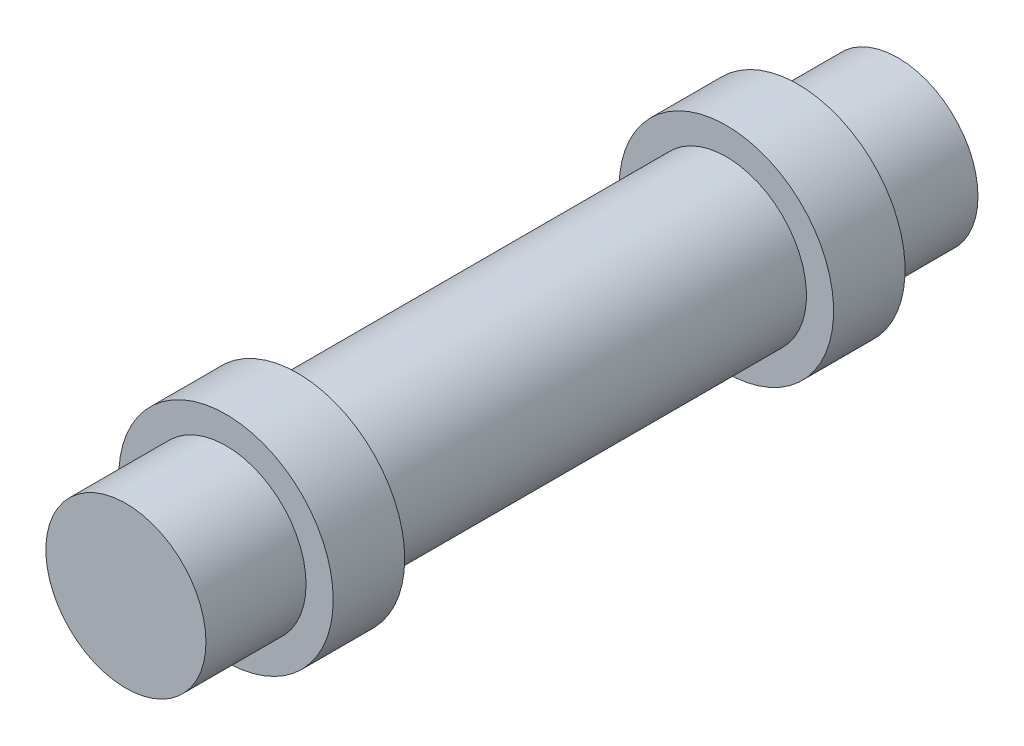
ISO-10303-21;
HEADER;
FILE_DESCRIPTION(('STEP AP214'),'2;1');
FILE_NAME('part.step','',(''),(''),'','','');
FILE_SCHEMA(('AUTOMOTIVE_DESIGN { 1 0 10303 214 1 1 1 1 }'));
ENDSEC;
DATA;
#1=APPLICATION_CONTEXT('core data for automotive mechanical design processes');
#2=APPLICATION_PROTOCOL_DEFINITION('international standard','automotive_design',2000,#1);
#3=PRODUCT_CONTEXT('',#1,'mechanical');
#4=PRODUCT('Part','Part','',(#3));
#5=PRODUCT_RELATED_PRODUCT_CATEGORY('part','',(#4));
#6=PRODUCT_DEFINITION_FORMATION('','',#4);
#7=PRODUCT_DEFINITION_CONTEXT('part definition',#1,'design');
#8=PRODUCT_DEFINITION('design','',#6,#7);
#9=PRODUCT_DEFINITION_SHAPE('','',#8);
#10=(LENGTH_UNIT() NAMED_UNIT(*) SI_UNIT(.MILLI.,.METRE.));
#11=(NAMED_UNIT(*) PLANE_ANGLE_UNIT() SI_UNIT($,.RADIAN.));
#12=(NAMED_UNIT(*) SI_UNIT($,.STERADIAN.) SOLID_ANGLE_UNIT());
#13=UNCERTAINTY_MEASURE_WITH_UNIT(LENGTH_MEASURE(1.E-05),#10,'distance_accuracy_value','');
#14=(GEOMETRIC_REPRESENTATION_CONTEXT(3) GLOBAL_UNCERTAINTY_ASSIGNED_CONTEXT((#13)) GLOBAL_UNIT_ASSIGNED_CONTEXT((#10,
#11,#12)) REPRESENTATION_CONTEXT('',''));
#15=CARTESIAN_POINT('',(0.,0.,0.));
#16=DIRECTION('',(0.,0.,1.));
#17=DIRECTION('',(1.,0.,0.));
#18=AXIS2_PLACEMENT_3D('',#15,#16,#17);
#19=CARTESIAN_POINT('',(0.,0.,54.));
#20=DIRECTION('',(0.,0.,-1.));
#21=DIRECTION('',(-1.,0.,0.));
#22=AXIS2_PLACEMENT_3D('',#19,#20,#21);
#23=CYLINDRICAL_SURFACE('',#22,5.6);
#24=CARTESIAN_POINT('',(0.,0.,42.));
#25=DIRECTION('',(0.,0.,1.));
#26=DIRECTION('',(1.,0.,0.));
#27=AXIS2_PLACEMENT_3D('',#24,#25,#26);
#28=CIRCLE('',#27,5.6);
#29=CARTESIAN_POINT('',(5.6,0.,42.));
#30=VERTEX_POINT('',#29);
#31=EDGE_CURVE('E45',#30,#30,#28,.T.);
#32=ORIENTED_EDGE('',*,*,#31,.F.);
#33=EDGE_LOOP('',(#32));
#34=FACE_BOUND('',#33,.T.);
#35=CARTESIAN_POINT('',(0.,0.,12.));
#36=DIRECTION('',(0.,0.,-1.));
#37=DIRECTION('',(-1.,0.,0.));
#38=AXIS2_PLACEMENT_3D('',#35,#36,#37);
#39=CIRCLE('',#38,5.6);
#40=CARTESIAN_POINT('',(-5.6,0.,12.));
#41=VERTEX_POINT('',#40);
#42=EDGE_CURVE('E10',#41,#41,#39,.T.);
#43=ORIENTED_EDGE('',*,*,#42,.F.);
#44=EDGE_LOOP('',(#43));
#45=FACE_BOUND('',#44,.T.);
#46=ADVANCED_FACE('F37',(#34,#45),#23,.T.);
#47=CARTESIAN_POINT('',(0.,0.,42.));
#48=DIRECTION('',(0.,0.,1.));
#49=DIRECTION('',(1.,0.,0.));
#50=AXIS2_PLACEMENT_3D('',#47,#48,#49);
#51=CYLINDRICAL_SURFACE('',#50,7.5);
#52=CARTESIAN_POINT('',(0.,0.,42.));
#53=DIRECTION('',(0.,0.,1.));
#54=DIRECTION('',(1.,0.,0.));
#55=AXIS2_PLACEMENT_3D('',#52,#53,#54);
#56=CIRCLE('',#55,7.5);
#57=CARTESIAN_POINT('',(7.5,0.,42.));
#58=VERTEX_POINT('',#57);
#59=EDGE_CURVE('E71',#58,#58,#56,.T.);
#60=ORIENTED_EDGE('',*,*,#59,.T.);
#61=EDGE_LOOP('',(#60));
#62=FACE_BOUND('',#61,.T.);
#63=CARTESIAN_POINT('',(0.,0.,47.));
#64=DIRECTION('',(0.,0.,1.));
#65=DIRECTION('',(1.,0.,0.));
#66=AXIS2_PLACEMENT_3D('',#63,#64,#65);
#67=CIRCLE('',#66,7.5);
#68=CARTESIAN_POINT('',(7.5,0.,47.));
#69=VERTEX_POINT('',#68);
#70=EDGE_CURVE('E64',#69,#69,#67,.T.);
#71=ORIENTED_EDGE('',*,*,#70,.F.);
#72=EDGE_LOOP('',(#71));
#73=FACE_BOUND('',#72,.T.);
#74=ADVANCED_FACE('F102',(#62,#73),#51,.T.);
#75=CARTESIAN_POINT('',(0.,0.,42.));
#76=DIRECTION('',(0.,0.,1.));
#77=DIRECTION('',(1.,0.,0.));
#78=AXIS2_PLACEMENT_3D('',#75,#76,#77);
#79=PLANE('',#78);
#80=ORIENTED_EDGE('',*,*,#31,.T.);
#81=EDGE_LOOP('',(#80));
#82=FACE_BOUND('',#81,.T.);
#83=ORIENTED_EDGE('',*,*,#59,.F.);
#84=EDGE_LOOP('',(#83));
#85=FACE_BOUND('',#84,.T.);
#86=ADVANCED_FACE('F98',(#82,#85),#79,.F.);
#87=CARTESIAN_POINT('',(0.,0.,47.));
#88=DIRECTION('',(0.,0.,1.));
#89=DIRECTION('',(1.,0.,0.));
#90=AXIS2_PLACEMENT_3D('',#87,#88,#89);
#91=PLANE('',#90);
#92=CARTESIAN_POINT('',(0.,0.,47.));
#93=DIRECTION('',(0.,0.,1.));
#94=DIRECTION('',(1.,0.,0.));
#95=AXIS2_PLACEMENT_3D('',#92,#93,#94);
#96=CIRCLE('',#95,5.6);
#97=CARTESIAN_POINT('',(5.6,0.,47.));
#98=VERTEX_POINT('',#97);
#99=EDGE_CURVE('E59',#98,#98,#96,.T.);
#100=ORIENTED_EDGE('',*,*,#99,.F.);
#101=EDGE_LOOP('',(#100));
#102=FACE_BOUND('',#101,.T.);
#103=ORIENTED_EDGE('',*,*,#70,.T.);
#104=EDGE_LOOP('',(#103));
#105=FACE_BOUND('',#104,.T.);
#106=ADVANCED_FACE('F94',(#102,#105),#91,.T.);
#107=CARTESIAN_POINT('',(0.,0.,54.));
#108=DIRECTION('',(0.,0.,1.));
#109=DIRECTION('',(1.,0.,0.));
#110=AXIS2_PLACEMENT_3D('',#107,#108,#109);
#111=PLANE('',#110);
#112=CARTESIAN_POINT('',(0.,0.,54.));
#113=DIRECTION('',(0.,0.,1.));
#114=DIRECTION('',(1.,0.,0.));
#115=AXIS2_PLACEMENT_3D('',#112,#113,#114);
#116=CIRCLE('',#115,5.6);
#117=CARTESIAN_POINT('',(5.6,0.,54.));
#118=VERTEX_POINT('',#117);
#119=EDGE_CURVE('E50',#118,#118,#116,.T.);
#120=ORIENTED_EDGE('',*,*,#119,.T.);
#121=EDGE_LOOP('',(#120));
#122=FACE_BOUND('',#121,.T.);
#123=ADVANCED_FACE('F97',(#122),#111,.T.);
#124=ORIENTED_EDGE('',*,*,#99,.T.);
#125=EDGE_LOOP('',(#124));
#126=FACE_BOUND('',#125,.T.);
#127=ORIENTED_EDGE('',*,*,#119,.F.);
#128=EDGE_LOOP('',(#127));
#129=FACE_BOUND('',#128,.T.);
#130=ADVANCED_FACE('F39',(#126,#129),#23,.T.);
#131=CARTESIAN_POINT('',(0.,0.,12.));
#132=DIRECTION('',(0.,0.,-1.));
#133=DIRECTION('',(-1.,0.,0.));
#134=AXIS2_PLACEMENT_3D('',#131,#132,#133);
#135=CYLINDRICAL_SURFACE('',#134,7.5);
#136=CARTESIAN_POINT('',(0.,0.,12.));
#137=DIRECTION('',(0.,0.,-1.));
#138=DIRECTION('',(-1.,0.,0.));
#139=AXIS2_PLACEMENT_3D('',#136,#137,#138);
#140=CIRCLE('',#139,7.5);
#141=CARTESIAN_POINT('',(-7.5,0.,12.));
#142=VERTEX_POINT('',#141);
#143=EDGE_CURVE('E65',#142,#142,#140,.T.);
#144=ORIENTED_EDGE('',*,*,#143,.T.);
#145=EDGE_LOOP('',(#144));
#146=FACE_BOUND('',#145,.T.);
#147=CARTESIAN_POINT('',(0.,0.,7.));
#148=DIRECTION('',(0.,0.,-1.));
#149=DIRECTION('',(-1.,0.,0.));
#150=AXIS2_PLACEMENT_3D('',#147,#148,#149);
#151=CIRCLE('',#150,7.5);
#152=CARTESIAN_POINT('',(-7.5,0.,7.));
#153=VERTEX_POINT('',#152);
#154=EDGE_CURVE('E74',#153,#153,#151,.T.);
#155=ORIENTED_EDGE('',*,*,#154,.F.);
#156=EDGE_LOOP('',(#155));
#157=FACE_BOUND('',#156,.T.);
#158=ADVANCED_FACE('F130',(#146,#157),#135,.T.);
#159=CARTESIAN_POINT('',(0.,0.,12.));
#160=DIRECTION('',(0.,0.,-1.));
#161=DIRECTION('',(-1.,0.,0.));
#162=AXIS2_PLACEMENT_3D('',#159,#160,#161);
#163=PLANE('',#162);
#164=ORIENTED_EDGE('',*,*,#42,.T.);
#165=EDGE_LOOP('',(#164));
#166=FACE_BOUND('',#165,.T.);
#167=ORIENTED_EDGE('',*,*,#143,.F.);
#168=EDGE_LOOP('',(#167));
#169=FACE_BOUND('',#168,.T.);
#170=ADVANCED_FACE('F124',(#166,#169),#163,.F.);
#171=CARTESIAN_POINT('',(0.,0.,7.));
#172=DIRECTION('',(0.,0.,-1.));
#173=DIRECTION('',(-1.,0.,0.));
#174=AXIS2_PLACEMENT_3D('',#171,#172,#173);
#175=PLANE('',#174);
#176=CARTESIAN_POINT('',(0.,0.,7.));
#177=DIRECTION('',(0.,0.,-1.));
#178=DIRECTION('',(-1.,0.,0.));
#179=AXIS2_PLACEMENT_3D('',#176,#177,#178);
#180=CIRCLE('',#179,5.6);
#181=CARTESIAN_POINT('',(-5.6,0.,7.));
#182=VERTEX_POINT('',#181);
#183=EDGE_CURVE('E61',#182,#182,#180,.T.);
#184=ORIENTED_EDGE('',*,*,#183,.F.);
#185=EDGE_LOOP('',(#184));
#186=FACE_BOUND('',#185,.T.);
#187=ORIENTED_EDGE('',*,*,#154,.T.);
#188=EDGE_LOOP('',(#187));
#189=FACE_BOUND('',#188,.T.);
#190=ADVANCED_FACE('F118',(#186,#189),#175,.T.);
#191=CARTESIAN_POINT('',(0.,0.,0.));
#192=DIRECTION('',(0.,0.,1.));
#193=DIRECTION('',(1.,0.,0.));
#194=AXIS2_PLACEMENT_3D('',#191,#192,#193);
#195=PLANE('',#194);
#196=CARTESIAN_POINT('',(0.,0.,0.));
#197=DIRECTION('',(0.,0.,1.));
#198=DIRECTION('',(1.,0.,0.));
#199=AXIS2_PLACEMENT_3D('',#196,#197,#198);
#200=CIRCLE('',#199,5.6);
#201=CARTESIAN_POINT('',(5.6,0.,0.));
#202=VERTEX_POINT('',#201);
#203=EDGE_CURVE('E56',#202,#202,#200,.T.);
#204=ORIENTED_EDGE('',*,*,#203,.F.);
#205=EDGE_LOOP('',(#204));
#206=FACE_BOUND('',#205,.T.);
#207=ADVANCED_FACE('F116',(#206),#195,.F.);
#208=ORIENTED_EDGE('',*,*,#183,.T.);
#209=EDGE_LOOP('',(#208));
#210=FACE_BOUND('',#209,.T.);
#211=ORIENTED_EDGE('',*,*,#203,.T.);
#212=EDGE_LOOP('',(#211));
#213=FACE_BOUND('',#212,.T.);
#214=ADVANCED_FACE('F112',(#210,#213),#23,.T.);
#215=CLOSED_SHELL('',(#46,#74,#86,#106,#123,#130,#158,#170,#190,#207,#214));
#216=MANIFOLD_SOLID_BREP('B2',#215);
#217=ADVANCED_BREP_SHAPE_REPRESENTATION('',(#18,#216),#14);
#218=SHAPE_DEFINITION_REPRESENTATION(#9,#217);
ENDSEC;
END-ISO-10303-21;
